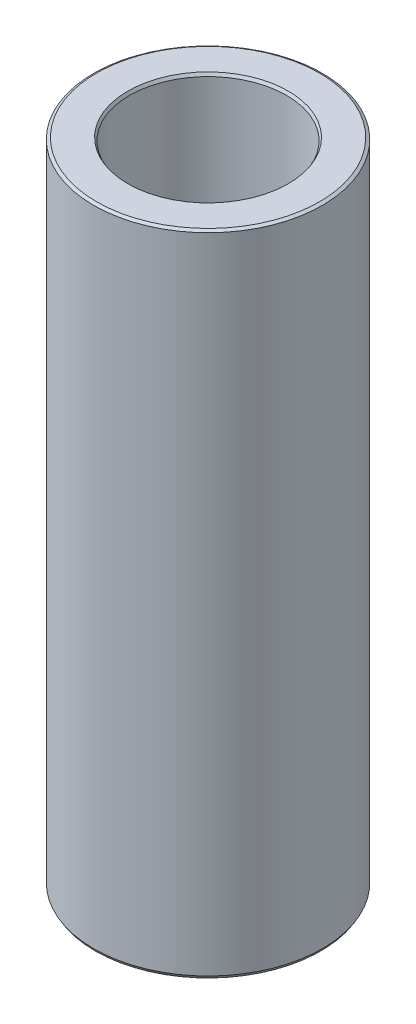
ISO-10303-21;
HEADER;
FILE_DESCRIPTION(('STEP AP214'),'2;1');
FILE_NAME('part.step','',(''),(''),'','','');
FILE_SCHEMA(('AUTOMOTIVE_DESIGN { 1 0 10303 214 1 1 1 1 }'));
ENDSEC;
DATA;
#1=APPLICATION_CONTEXT('core data for automotive mechanical design processes');
#2=APPLICATION_PROTOCOL_DEFINITION('international standard','automotive_design',2000,#1);
#3=PRODUCT_CONTEXT('',#1,'mechanical');
#4=PRODUCT('Part','Part','',(#3));
#5=PRODUCT_RELATED_PRODUCT_CATEGORY('part','',(#4));
#6=PRODUCT_DEFINITION_FORMATION('','',#4);
#7=PRODUCT_DEFINITION_CONTEXT('part definition',#1,'design');
#8=PRODUCT_DEFINITION('design','',#6,#7);
#9=PRODUCT_DEFINITION_SHAPE('','',#8);
#10=(LENGTH_UNIT() NAMED_UNIT(*) SI_UNIT(.MILLI.,.METRE.));
#11=(NAMED_UNIT(*) PLANE_ANGLE_UNIT() SI_UNIT($,.RADIAN.));
#12=(NAMED_UNIT(*) SI_UNIT($,.STERADIAN.) SOLID_ANGLE_UNIT());
#13=UNCERTAINTY_MEASURE_WITH_UNIT(LENGTH_MEASURE(1.E-05),#10,'distance_accuracy_value','');
#14=(GEOMETRIC_REPRESENTATION_CONTEXT(3) GLOBAL_UNCERTAINTY_ASSIGNED_CONTEXT((#13)) GLOBAL_UNIT_ASSIGNED_CONTEXT((#10,
#11,#12)) REPRESENTATION_CONTEXT('',''));
#15=CARTESIAN_POINT('',(0.,0.,0.));
#16=DIRECTION('',(0.,0.,1.));
#17=DIRECTION('',(1.,0.,0.));
#18=AXIS2_PLACEMENT_3D('',#15,#16,#17);
#19=CARTESIAN_POINT('',(0.,297.531425896706,0.));
#20=DIRECTION('',(0.,-1.,0.));
#21=DIRECTION('',(0.,0.,-1.));
#22=AXIS2_PLACEMENT_3D('',#19,#20,#21);
#23=CYLINDRICAL_SURFACE('',#22,52.5);
#24=CARTESIAN_POINT('',(0.,1.32810246338816,0.));
#25=DIRECTION('',(0.,1.,0.));
#26=DIRECTION('',(0.,0.,1.));
#27=AXIS2_PLACEMENT_3D('',#24,#25,#26);
#28=CIRCLE('',#27,52.5);
#29=CARTESIAN_POINT('',(0.,1.32810246338816,52.5));
#30=VERTEX_POINT('',#29);
#31=EDGE_CURVE('E10',#30,#30,#28,.T.);
#32=ORIENTED_EDGE('',*,*,#31,.T.);
#33=EDGE_LOOP('',(#32));
#34=FACE_BOUND('',#33,.T.);
#35=CARTESIAN_POINT('',(0.,296.764645581957,0.));
#36=DIRECTION('',(0.,1.,0.));
#37=DIRECTION('',(0.,0.,1.));
#38=AXIS2_PLACEMENT_3D('',#35,#36,#37);
#39=CIRCLE('',#38,52.5);
#40=CARTESIAN_POINT('',(0.,296.764645581957,52.5));
#41=VERTEX_POINT('',#40);
#42=EDGE_CURVE('E50',#41,#41,#39,.F.);
#43=ORIENTED_EDGE('',*,*,#42,.T.);
#44=EDGE_LOOP('',(#43));
#45=FACE_BOUND('',#44,.T.);
#46=ADVANCED_FACE('F39',(#34,#45),#23,.T.);
#47=CARTESIAN_POINT('',(0.,297.531425896706,0.));
#48=DIRECTION('',(0.,1.,0.));
#49=DIRECTION('',(0.,0.,1.));
#50=AXIS2_PLACEMENT_3D('',#47,#48,#49);
#51=PLANE('',#50);
#52=CARTESIAN_POINT('',(0.,297.531425896706,0.));
#53=DIRECTION('',(0.,1.,0.));
#54=DIRECTION('',(0.,0.,1.));
#55=AXIS2_PLACEMENT_3D('',#52,#53,#54);
#56=CIRCLE('',#55,36.8333427906243);
#57=CARTESIAN_POINT('',(0.,297.531425896706,36.8333427906243));
#58=VERTEX_POINT('',#57);
#59=EDGE_CURVE('E58',#58,#58,#56,.F.);
#60=ORIENTED_EDGE('',*,*,#59,.T.);
#61=EDGE_LOOP('',(#60));
#62=FACE_BOUND('',#61,.T.);
#63=CARTESIAN_POINT('',(0.,297.531425896706,0.));
#64=DIRECTION('',(0.,1.,0.));
#65=DIRECTION('',(0.,0.,1.));
#66=AXIS2_PLACEMENT_3D('',#63,#64,#65);
#67=CIRCLE('',#66,51.1718975366117);
#68=CARTESIAN_POINT('',(0.,297.531425896706,51.1718975366117));
#69=VERTEX_POINT('',#68);
#70=EDGE_CURVE('E61',#69,#69,#67,.T.);
#71=ORIENTED_EDGE('',*,*,#70,.T.);
#72=EDGE_LOOP('',(#71));
#73=FACE_BOUND('',#72,.T.);
#74=ADVANCED_FACE('F88',(#62,#73),#51,.T.);
#75=CARTESIAN_POINT('',(0.,0.,0.));
#76=DIRECTION('',(0.,1.,0.));
#77=DIRECTION('',(0.,0.,1.));
#78=AXIS2_PLACEMENT_3D('',#75,#76,#77);
#79=PLANE('',#78);
#80=CARTESIAN_POINT('',(0.,0.,0.));
#81=DIRECTION('',(0.,1.,0.));
#82=DIRECTION('',(0.,0.,1.));
#83=AXIS2_PLACEMENT_3D('',#80,#81,#82);
#84=CIRCLE('',#83,37.3946649392639);
#85=CARTESIAN_POINT('',(0.,0.,37.3946649392639));
#86=VERTEX_POINT('',#85);
#87=EDGE_CURVE('E51',#86,#86,#84,.T.);
#88=ORIENTED_EDGE('',*,*,#87,.T.);
#89=EDGE_LOOP('',(#88));
#90=FACE_BOUND('',#89,.T.);
#91=CARTESIAN_POINT('',(0.,0.,0.));
#92=DIRECTION('',(0.,1.,0.));
#93=DIRECTION('',(0.,0.,1.));
#94=AXIS2_PLACEMENT_3D('',#91,#92,#93);
#95=CIRCLE('',#94,51.7332196852514);
#96=CARTESIAN_POINT('',(0.,0.,51.7332196852514));
#97=VERTEX_POINT('',#96);
#98=EDGE_CURVE('E54',#97,#97,#95,.F.);
#99=ORIENTED_EDGE('',*,*,#98,.T.);
#100=EDGE_LOOP('',(#99));
#101=FACE_BOUND('',#100,.T.);
#102=ADVANCED_FACE('F83',(#90,#101),#79,.F.);
#103=CARTESIAN_POINT('',(0.,297.531425896706,0.));
#104=DIRECTION('',(0.,-1.,0.));
#105=DIRECTION('',(0.,0.,-1.));
#106=AXIS2_PLACEMENT_3D('',#103,#104,#105);
#107=CYLINDRICAL_SURFACE('',#106,36.0665624758756);
#108=CARTESIAN_POINT('',(0.,296.203323433318,0.));
#109=DIRECTION('',(0.,1.,0.));
#110=DIRECTION('',(0.,0.,1.));
#111=AXIS2_PLACEMENT_3D('',#108,#109,#110);
#112=CIRCLE('',#111,36.0665624758756);
#113=CARTESIAN_POINT('',(0.,296.203323433318,36.0665624758756));
#114=VERTEX_POINT('',#113);
#115=EDGE_CURVE('E67',#114,#114,#112,.T.);
#116=ORIENTED_EDGE('',*,*,#115,.T.);
#117=EDGE_LOOP('',(#116));
#118=FACE_BOUND('',#117,.T.);
#119=CARTESIAN_POINT('',(0.,0.766780314748639,0.));
#120=DIRECTION('',(0.,1.,0.));
#121=DIRECTION('',(0.,0.,1.));
#122=AXIS2_PLACEMENT_3D('',#119,#120,#121);
#123=CIRCLE('',#122,36.0665624758756);
#124=CARTESIAN_POINT('',(0.,0.766780314748639,36.0665624758756));
#125=VERTEX_POINT('',#124);
#126=EDGE_CURVE('E69',#125,#125,#123,.F.);
#127=ORIENTED_EDGE('',*,*,#126,.T.);
#128=EDGE_LOOP('',(#127));
#129=FACE_BOUND('',#128,.T.);
#130=ADVANCED_FACE('F71',(#118,#129),#107,.F.);
#131=CARTESIAN_POINT('',(0.,296.203323433318,0.));
#132=DIRECTION('',(0.,1.,0.));
#133=DIRECTION('',(0.,0.,1.));
#134=AXIS2_PLACEMENT_3D('',#131,#132,#133);
#135=CONICAL_SURFACE('',#134,36.0665624758756,0.523598775598307);
#136=ORIENTED_EDGE('',*,*,#59,.F.);
#137=EDGE_LOOP('',(#136));
#138=FACE_BOUND('',#137,.T.);
#139=ORIENTED_EDGE('',*,*,#115,.F.);
#140=EDGE_LOOP('',(#139));
#141=FACE_BOUND('',#140,.T.);
#142=ADVANCED_FACE('F77',(#138,#141),#135,.F.);
#143=CARTESIAN_POINT('',(0.,0.,0.));
#144=DIRECTION('',(0.,-1.,0.));
#145=DIRECTION('',(0.,0.,-1.));
#146=AXIS2_PLACEMENT_3D('',#143,#144,#145);
#147=CONICAL_SURFACE('',#146,37.3946649392639,1.04719755119659);
#148=ORIENTED_EDGE('',*,*,#126,.F.);
#149=EDGE_LOOP('',(#148));
#150=FACE_BOUND('',#149,.T.);
#151=ORIENTED_EDGE('',*,*,#87,.F.);
#152=EDGE_LOOP('',(#151));
#153=FACE_BOUND('',#152,.T.);
#154=ADVANCED_FACE('F73',(#150,#153),#147,.F.);
#155=CARTESIAN_POINT('',(0.,1.32810246338816,0.));
#156=DIRECTION('',(0.,1.,0.));
#157=DIRECTION('',(0.,0.,1.));
#158=AXIS2_PLACEMENT_3D('',#155,#156,#157);
#159=CONICAL_SURFACE('',#158,52.5,0.523598775598317);
#160=ORIENTED_EDGE('',*,*,#98,.F.);
#161=EDGE_LOOP('',(#160));
#162=FACE_BOUND('',#161,.T.);
#163=ORIENTED_EDGE('',*,*,#31,.F.);
#164=EDGE_LOOP('',(#163));
#165=FACE_BOUND('',#164,.T.);
#166=ADVANCED_FACE('F76',(#162,#165),#159,.T.);
#167=CARTESIAN_POINT('',(0.,297.531425896706,0.));
#168=DIRECTION('',(0.,-1.,0.));
#169=DIRECTION('',(0.,0.,-1.));
#170=AXIS2_PLACEMENT_3D('',#167,#168,#169);
#171=CONICAL_SURFACE('',#170,51.1718975366117,1.04719755119658);
#172=ORIENTED_EDGE('',*,*,#42,.F.);
#173=EDGE_LOOP('',(#172));
#174=FACE_BOUND('',#173,.T.);
#175=ORIENTED_EDGE('',*,*,#70,.F.);
#176=EDGE_LOOP('',(#175));
#177=FACE_BOUND('',#176,.T.);
#178=ADVANCED_FACE('F45',(#174,#177),#171,.T.);
#179=CLOSED_SHELL('',(#46,#74,#102,#130,#142,#154,#166,#178));
#180=MANIFOLD_SOLID_BREP('B2',#179);
#181=ADVANCED_BREP_SHAPE_REPRESENTATION('',(#18,#180),#14);
#182=SHAPE_DEFINITION_REPRESENTATION(#9,#181);
ENDSEC;
END-ISO-10303-21;
